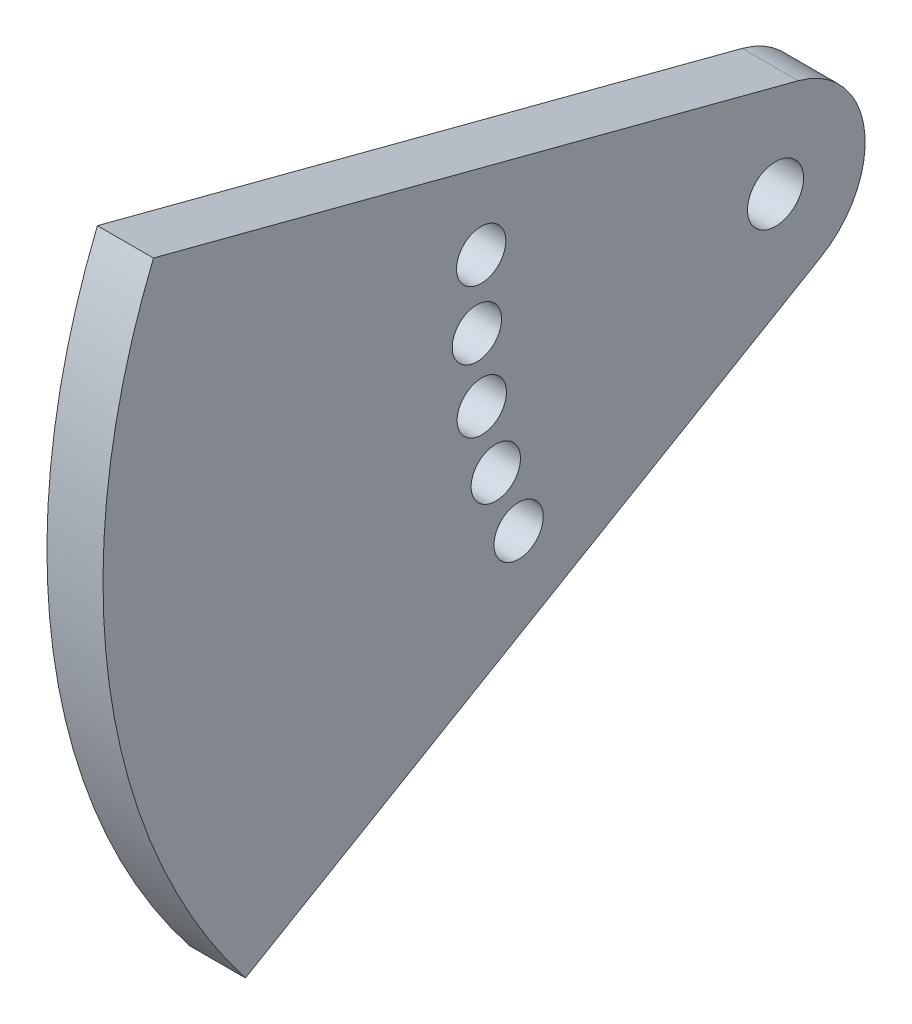
ISO-10303-21;
HEADER;
FILE_DESCRIPTION(('STEP AP214'),'2;1');
FILE_NAME('part.step','',(''),(''),'','','');
FILE_SCHEMA(('AUTOMOTIVE_DESIGN { 1 0 10303 214 1 1 1 1 }'));
ENDSEC;
DATA;
#1=APPLICATION_CONTEXT('core data for automotive mechanical design processes');
#2=APPLICATION_PROTOCOL_DEFINITION('international standard','automotive_design',2000,#1);
#3=PRODUCT_CONTEXT('',#1,'mechanical');
#4=PRODUCT('Part','Part','',(#3));
#5=PRODUCT_RELATED_PRODUCT_CATEGORY('part','',(#4));
#6=PRODUCT_DEFINITION_FORMATION('','',#4);
#7=PRODUCT_DEFINITION_CONTEXT('part definition',#1,'design');
#8=PRODUCT_DEFINITION('design','',#6,#7);
#9=PRODUCT_DEFINITION_SHAPE('','',#8);
#10=(LENGTH_UNIT() NAMED_UNIT(*) SI_UNIT(.MILLI.,.METRE.));
#11=(NAMED_UNIT(*) PLANE_ANGLE_UNIT() SI_UNIT($,.RADIAN.));
#12=(NAMED_UNIT(*) SI_UNIT($,.STERADIAN.) SOLID_ANGLE_UNIT());
#13=UNCERTAINTY_MEASURE_WITH_UNIT(LENGTH_MEASURE(1.E-05),#10,'distance_accuracy_value','');
#14=(GEOMETRIC_REPRESENTATION_CONTEXT(3) GLOBAL_UNCERTAINTY_ASSIGNED_CONTEXT((#13)) GLOBAL_UNIT_ASSIGNED_CONTEXT((#10,
#11,#12)) REPRESENTATION_CONTEXT('',''));
#15=CARTESIAN_POINT('',(0.,0.,0.));
#16=DIRECTION('',(0.,0.,1.));
#17=DIRECTION('',(1.,0.,0.));
#18=AXIS2_PLACEMENT_3D('',#15,#16,#17);
#19=CARTESIAN_POINT('',(6.35,0.,0.));
#20=DIRECTION('',(-1.,0.,0.));
#21=DIRECTION('',(0.,0.,1.));
#22=AXIS2_PLACEMENT_3D('',#19,#20,#21);
#23=CYLINDRICAL_SURFACE('',#22,10.16);
#24=CARTESIAN_POINT('',(0.,0.,0.));
#25=DIRECTION('',(1.,0.,0.));
#26=DIRECTION('',(0.,0.,-1.));
#27=AXIS2_PLACEMENT_3D('',#24,#25,#26);
#28=CIRCLE('',#27,10.16);
#29=CARTESIAN_POINT('',(0.,9.82856566886016,-2.57388750587578));
#30=VERTEX_POINT('',#29);
#31=CARTESIAN_POINT('',(0.,-8.7698587432044,-5.12983212437224));
#32=VERTEX_POINT('',#31);
#33=EDGE_CURVE('E117',#30,#32,#28,.F.);
#34=ORIENTED_EDGE('',*,*,#33,.F.);
#35=DIRECTION('',(-1.,0.,0.));
#36=VECTOR('',#35,1.);
#37=CARTESIAN_POINT('',(6.35,9.82856566886016,-2.57388750587578));
#38=LINE('',#37,#36);
#39=CARTESIAN_POINT('',(6.35,9.82856566886016,-2.57388750587578));
#40=VERTEX_POINT('',#39);
#41=EDGE_CURVE('E11',#40,#30,#38,.T.);
#42=ORIENTED_EDGE('',*,*,#41,.F.);
#43=CARTESIAN_POINT('',(6.35,0.,0.));
#44=DIRECTION('',(1.,0.,0.));
#45=DIRECTION('',(0.,0.,-1.));
#46=AXIS2_PLACEMENT_3D('',#43,#44,#45);
#47=CIRCLE('',#46,10.16);
#48=CARTESIAN_POINT('',(6.35,-8.7698587432044,-5.12983212437224));
#49=VERTEX_POINT('',#48);
#50=EDGE_CURVE('E84',#40,#49,#47,.F.);
#51=ORIENTED_EDGE('',*,*,#50,.T.);
#52=DIRECTION('',(-1.,0.,0.));
#53=VECTOR('',#52,1.);
#54=CARTESIAN_POINT('',(6.35,-8.7698587432044,-5.12983212437224));
#55=LINE('',#54,#53);
#56=EDGE_CURVE('E52',#49,#32,#55,.T.);
#57=ORIENTED_EDGE('',*,*,#56,.T.);
#58=EDGE_LOOP('',(#34,#42,#51,#57));
#59=FACE_BOUND('',#58,.T.);
#60=ADVANCED_FACE('F35',(#59),#23,.T.);
#61=CARTESIAN_POINT('',(6.35,9.82856566886016,-2.57388750587578));
#62=DIRECTION('',(0.,-0.967378510714583,0.253335384436593));
#63=DIRECTION('',(0.,-0.253335384436593,-0.967378510714583));
#64=AXIS2_PLACEMENT_3D('',#61,#62,#63);
#65=PLANE('',#64);
#66=DIRECTION('',(0.,0.253335384436593,0.967378510714583));
#67=VECTOR('',#66,1.);
#68=CARTESIAN_POINT('',(0.,9.82856566886016,-2.57388750587578));
#69=LINE('',#68,#67);
#70=CARTESIAN_POINT('',(0.,28.9603599739669,70.482178954529));
#71=VERTEX_POINT('',#70);
#72=EDGE_CURVE('E90',#30,#71,#69,.T.);
#73=ORIENTED_EDGE('',*,*,#72,.T.);
#74=DIRECTION('',(-1.,0.,0.));
#75=VECTOR('',#74,1.);
#76=CARTESIAN_POINT('',(6.35,28.9603599739669,70.482178954529));
#77=LINE('',#76,#75);
#78=CARTESIAN_POINT('',(6.35,28.9603599739669,70.482178954529));
#79=VERTEX_POINT('',#78);
#80=EDGE_CURVE('E44',#79,#71,#77,.T.);
#81=ORIENTED_EDGE('',*,*,#80,.F.);
#82=DIRECTION('',(0.,0.253335384436593,0.967378510714583));
#83=VECTOR('',#82,1.);
#84=CARTESIAN_POINT('',(6.35,9.82856566886016,-2.57388750587578));
#85=LINE('',#84,#83);
#86=EDGE_CURVE('E78',#40,#79,#85,.T.);
#87=ORIENTED_EDGE('',*,*,#86,.F.);
#88=ORIENTED_EDGE('',*,*,#41,.T.);
#89=EDGE_LOOP('',(#73,#81,#87,#88));
#90=FACE_BOUND('',#89,.T.);
#91=ADVANCED_FACE('F88',(#90),#65,.F.);
#92=CARTESIAN_POINT('',(6.35,0.,0.));
#93=DIRECTION('',(-1.,0.,0.));
#94=DIRECTION('',(0.,0.,1.));
#95=AXIS2_PLACEMENT_3D('',#92,#93,#94);
#96=CYLINDRICAL_SURFACE('',#95,76.2);
#97=CARTESIAN_POINT('',(0.,0.,0.));
#98=DIRECTION('',(1.,0.,0.));
#99=DIRECTION('',(0.,0.,-1.));
#100=AXIS2_PLACEMENT_3D('',#97,#98,#99);
#101=CIRCLE('',#100,76.2);
#102=CARTESIAN_POINT('',(0.,-46.9000772547647,60.0568293660022));
#103=VERTEX_POINT('',#102);
#104=EDGE_CURVE('E120',#103,#71,#101,.F.);
#105=ORIENTED_EDGE('',*,*,#104,.F.);
#106=DIRECTION('',(-1.,0.,0.));
#107=VECTOR('',#106,1.);
#108=CARTESIAN_POINT('',(6.35,-46.9000772547647,60.0568293660022));
#109=LINE('',#108,#107);
#110=CARTESIAN_POINT('',(6.35,-46.9000772547647,60.0568293660022));
#111=VERTEX_POINT('',#110);
#112=EDGE_CURVE('E65',#111,#103,#109,.T.);
#113=ORIENTED_EDGE('',*,*,#112,.F.);
#114=CARTESIAN_POINT('',(6.35,0.,0.));
#115=DIRECTION('',(1.,0.,0.));
#116=DIRECTION('',(0.,0.,-1.));
#117=AXIS2_PLACEMENT_3D('',#114,#115,#116);
#118=CIRCLE('',#117,76.2);
#119=EDGE_CURVE('E83',#111,#79,#118,.F.);
#120=ORIENTED_EDGE('',*,*,#119,.T.);
#121=ORIENTED_EDGE('',*,*,#80,.T.);
#122=EDGE_LOOP('',(#105,#113,#120,#121));
#123=FACE_BOUND('',#122,.T.);
#124=ADVANCED_FACE('F93',(#123),#96,.T.);
#125=CARTESIAN_POINT('',(6.35,10.6999868382995,33.3471670411148));
#126=DIRECTION('',(-1.,0.,0.));
#127=DIRECTION('',(0.,0.,1.));
#128=AXIS2_PLACEMENT_3D('',#125,#126,#127);
#129=CYLINDRICAL_SURFACE('',#128,2.794);
#130=CARTESIAN_POINT('',(6.35,10.6999868382995,33.3471670411148));
#131=DIRECTION('',(1.,0.,0.));
#132=DIRECTION('',(0.,0.,-1.));
#133=AXIS2_PLACEMENT_3D('',#130,#131,#132);
#134=CIRCLE('',#133,2.794);
#135=CARTESIAN_POINT('',(6.35,10.6999868382995,30.5531670411148));
#136=VERTEX_POINT('',#135);
#137=EDGE_CURVE('E145',#136,#136,#134,.T.);
#138=ORIENTED_EDGE('',*,*,#137,.T.);
#139=EDGE_LOOP('',(#138));
#140=FACE_BOUND('',#139,.T.);
#141=CARTESIAN_POINT('',(0.,10.6999868382995,33.3471670411148));
#142=DIRECTION('',(1.,0.,0.));
#143=DIRECTION('',(0.,0.,-1.));
#144=AXIS2_PLACEMENT_3D('',#141,#142,#143);
#145=CIRCLE('',#144,2.794);
#146=CARTESIAN_POINT('',(0.,10.6999868382995,30.5531670411148));
#147=VERTEX_POINT('',#146);
#148=EDGE_CURVE('E114',#147,#147,#145,.T.);
#149=ORIENTED_EDGE('',*,*,#148,.F.);
#150=EDGE_LOOP('',(#149));
#151=FACE_BOUND('',#150,.T.);
#152=ADVANCED_FACE('F167',(#140,#151),#129,.F.);
#153=CARTESIAN_POINT('',(6.35,3.25056568996349,33.8328164493452));
#154=DIRECTION('',(-1.,0.,0.));
#155=DIRECTION('',(0.,0.,1.));
#156=AXIS2_PLACEMENT_3D('',#153,#154,#155);
#157=CYLINDRICAL_SURFACE('',#156,2.79399999999999);
#158=CARTESIAN_POINT('',(6.35,3.25056568996349,33.8328164493452));
#159=DIRECTION('',(1.,0.,0.));
#160=DIRECTION('',(0.,0.,-1.));
#161=AXIS2_PLACEMENT_3D('',#158,#159,#160);
#162=CIRCLE('',#161,2.79399999999999);
#163=CARTESIAN_POINT('',(6.35,3.25056568996349,31.0388164493452));
#164=VERTEX_POINT('',#163);
#165=EDGE_CURVE('E142',#164,#164,#162,.T.);
#166=ORIENTED_EDGE('',*,*,#165,.T.);
#167=EDGE_LOOP('',(#166));
#168=FACE_BOUND('',#167,.T.);
#169=CARTESIAN_POINT('',(0.,3.25056568996349,33.8328164493452));
#170=DIRECTION('',(1.,0.,0.));
#171=DIRECTION('',(0.,0.,-1.));
#172=AXIS2_PLACEMENT_3D('',#169,#170,#171);
#173=CIRCLE('',#172,2.79399999999999);
#174=CARTESIAN_POINT('',(0.,3.25056568996349,31.0388164493452));
#175=VERTEX_POINT('',#174);
#176=EDGE_CURVE('E111',#175,#175,#173,.T.);
#177=ORIENTED_EDGE('',*,*,#176,.F.);
#178=EDGE_LOOP('',(#177));
#179=FACE_BOUND('',#178,.T.);
#180=ADVANCED_FACE('F170',(#168,#179),#157,.F.);
#181=CARTESIAN_POINT('',(6.35,-4.19394753796468,33.2769805093475));
#182=DIRECTION('',(-1.,0.,0.));
#183=DIRECTION('',(0.,0.,1.));
#184=AXIS2_PLACEMENT_3D('',#181,#182,#183);
#185=CYLINDRICAL_SURFACE('',#184,2.794);
#186=CARTESIAN_POINT('',(6.35,-4.19394753796468,33.2769805093475));
#187=DIRECTION('',(1.,0.,0.));
#188=DIRECTION('',(0.,0.,-1.));
#189=AXIS2_PLACEMENT_3D('',#186,#187,#188);
#190=CIRCLE('',#189,2.794);
#191=CARTESIAN_POINT('',(6.35,-4.19394753796468,30.4829805093475));
#192=VERTEX_POINT('',#191);
#193=EDGE_CURVE('E139',#192,#192,#190,.T.);
#194=ORIENTED_EDGE('',*,*,#193,.T.);
#195=EDGE_LOOP('',(#194));
#196=FACE_BOUND('',#195,.T.);
#197=CARTESIAN_POINT('',(0.,-4.19394753796468,33.2769805093475));
#198=DIRECTION('',(1.,0.,0.));
#199=DIRECTION('',(0.,0.,-1.));
#200=AXIS2_PLACEMENT_3D('',#197,#198,#199);
#201=CIRCLE('',#200,2.794);
#202=CARTESIAN_POINT('',(0.,-4.19394753796468,30.4829805093475));
#203=VERTEX_POINT('',#202);
#204=EDGE_CURVE('E108',#203,#203,#201,.T.);
#205=ORIENTED_EDGE('',*,*,#204,.F.);
#206=EDGE_LOOP('',(#205));
#207=FACE_BOUND('',#206,.T.);
#208=ADVANCED_FACE('F174',(#196,#207),#185,.F.);
#209=CARTESIAN_POINT('',(6.35,-11.4886538635116,31.6904779354398));
#210=DIRECTION('',(-1.,0.,0.));
#211=DIRECTION('',(0.,0.,1.));
#212=AXIS2_PLACEMENT_3D('',#209,#210,#211);
#213=CYLINDRICAL_SURFACE('',#212,2.794);
#214=CARTESIAN_POINT('',(6.35,-11.4886538635116,31.6904779354398));
#215=DIRECTION('',(1.,0.,0.));
#216=DIRECTION('',(0.,0.,-1.));
#217=AXIS2_PLACEMENT_3D('',#214,#215,#216);
#218=CIRCLE('',#217,2.794);
#219=CARTESIAN_POINT('',(6.35,-11.4886538635116,28.8964779354398));
#220=VERTEX_POINT('',#219);
#221=EDGE_CURVE('E134',#220,#220,#218,.T.);
#222=ORIENTED_EDGE('',*,*,#221,.T.);
#223=EDGE_LOOP('',(#222));
#224=FACE_BOUND('',#223,.T.);
#225=CARTESIAN_POINT('',(0.,-11.4886538635116,31.6904779354398));
#226=DIRECTION('',(1.,0.,0.));
#227=DIRECTION('',(0.,0.,-1.));
#228=AXIS2_PLACEMENT_3D('',#225,#226,#227);
#229=CIRCLE('',#228,2.794);
#230=CARTESIAN_POINT('',(0.,-11.4886538635116,28.8964779354398));
#231=VERTEX_POINT('',#230);
#232=EDGE_CURVE('E105',#231,#231,#229,.T.);
#233=ORIENTED_EDGE('',*,*,#232,.F.);
#234=EDGE_LOOP('',(#233));
#235=FACE_BOUND('',#234,.T.);
#236=ADVANCED_FACE('F178',(#224,#235),#213,.F.);
#237=CARTESIAN_POINT('',(6.35,-18.4915701256561,29.1041881956034));
#238=DIRECTION('',(-1.,0.,0.));
#239=DIRECTION('',(0.,0.,1.));
#240=AXIS2_PLACEMENT_3D('',#237,#238,#239);
#241=CYLINDRICAL_SURFACE('',#240,2.79400000000008);
#242=CARTESIAN_POINT('',(6.35,-18.4915701256561,29.1041881956034));
#243=DIRECTION('',(1.,0.,0.));
#244=DIRECTION('',(0.,0.,-1.));
#245=AXIS2_PLACEMENT_3D('',#242,#243,#244);
#246=CIRCLE('',#245,2.79400000000008);
#247=CARTESIAN_POINT('',(6.35,-18.4915701256561,26.3101881956033));
#248=VERTEX_POINT('',#247);
#249=EDGE_CURVE('E129',#248,#248,#246,.T.);
#250=ORIENTED_EDGE('',*,*,#249,.T.);
#251=EDGE_LOOP('',(#250));
#252=FACE_BOUND('',#251,.T.);
#253=CARTESIAN_POINT('',(0.,-18.4915701256561,29.1041881956034));
#254=DIRECTION('',(1.,0.,0.));
#255=DIRECTION('',(0.,0.,-1.));
#256=AXIS2_PLACEMENT_3D('',#253,#254,#255);
#257=CIRCLE('',#256,2.79400000000008);
#258=CARTESIAN_POINT('',(0.,-18.4915701256561,26.3101881956033));
#259=VERTEX_POINT('',#258);
#260=EDGE_CURVE('E102',#259,#259,#257,.T.);
#261=ORIENTED_EDGE('',*,*,#260,.F.);
#262=EDGE_LOOP('',(#261));
#263=FACE_BOUND('',#262,.T.);
#264=ADVANCED_FACE('F157',(#252,#263),#241,.F.);
#265=CARTESIAN_POINT('',(6.35,0.,0.));
#266=DIRECTION('',(-1.,0.,0.));
#267=DIRECTION('',(0.,0.,1.));
#268=AXIS2_PLACEMENT_3D('',#265,#266,#267);
#269=CYLINDRICAL_SURFACE('',#268,3.175);
#270=CARTESIAN_POINT('',(6.35,0.,0.));
#271=DIRECTION('',(1.,0.,0.));
#272=DIRECTION('',(0.,0.,-1.));
#273=AXIS2_PLACEMENT_3D('',#270,#271,#272);
#274=CIRCLE('',#273,3.175);
#275=CARTESIAN_POINT('',(6.35,0.,-3.175));
#276=VERTEX_POINT('',#275);
#277=EDGE_CURVE('E125',#276,#276,#274,.T.);
#278=ORIENTED_EDGE('',*,*,#277,.T.);
#279=EDGE_LOOP('',(#278));
#280=FACE_BOUND('',#279,.T.);
#281=CARTESIAN_POINT('',(0.,0.,0.));
#282=DIRECTION('',(1.,0.,0.));
#283=DIRECTION('',(0.,0.,-1.));
#284=AXIS2_PLACEMENT_3D('',#281,#282,#283);
#285=CIRCLE('',#284,3.175);
#286=CARTESIAN_POINT('',(0.,0.,-3.175));
#287=VERTEX_POINT('',#286);
#288=EDGE_CURVE('E99',#287,#287,#285,.T.);
#289=ORIENTED_EDGE('',*,*,#288,.F.);
#290=EDGE_LOOP('',(#289));
#291=FACE_BOUND('',#290,.T.);
#292=ADVANCED_FACE('F37',(#280,#291),#269,.F.);
#293=CARTESIAN_POINT('',(6.35,-8.7698587432044,-5.12983212437224));
#294=DIRECTION('',(0.,-0.863175073150039,-0.50490473665081));
#295=DIRECTION('',(0.,0.50490473665081,-0.863175073150039));
#296=AXIS2_PLACEMENT_3D('',#293,#294,#295);
#297=PLANE('',#296);
#298=DIRECTION('',(0.,-0.50490473665081,0.863175073150039));
#299=VECTOR('',#298,1.);
#300=CARTESIAN_POINT('',(0.,-8.7698587432044,-5.12983212437224));
#301=LINE('',#300,#299);
#302=EDGE_CURVE('E122',#32,#103,#301,.T.);
#303=ORIENTED_EDGE('',*,*,#302,.F.);
#304=ORIENTED_EDGE('',*,*,#56,.F.);
#305=DIRECTION('',(0.,-0.50490473665081,0.863175073150039));
#306=VECTOR('',#305,1.);
#307=CARTESIAN_POINT('',(6.35,-8.7698587432044,-5.12983212437224));
#308=LINE('',#307,#306);
#309=EDGE_CURVE('E94',#49,#111,#308,.T.);
#310=ORIENTED_EDGE('',*,*,#309,.T.);
#311=ORIENTED_EDGE('',*,*,#112,.T.);
#312=EDGE_LOOP('',(#303,#304,#310,#311));
#313=FACE_BOUND('',#312,.T.);
#314=ADVANCED_FACE('F147',(#313),#297,.T.);
#315=CARTESIAN_POINT('',(6.35,0.,0.));
#316=DIRECTION('',(1.,0.,0.));
#317=DIRECTION('',(0.,0.,-1.));
#318=AXIS2_PLACEMENT_3D('',#315,#316,#317);
#319=PLANE('',#318);
#320=ORIENTED_EDGE('',*,*,#277,.F.);
#321=EDGE_LOOP('',(#320));
#322=FACE_BOUND('',#321,.T.);
#323=ORIENTED_EDGE('',*,*,#249,.F.);
#324=EDGE_LOOP('',(#323));
#325=FACE_BOUND('',#324,.T.);
#326=ORIENTED_EDGE('',*,*,#221,.F.);
#327=EDGE_LOOP('',(#326));
#328=FACE_BOUND('',#327,.T.);
#329=ORIENTED_EDGE('',*,*,#193,.F.);
#330=EDGE_LOOP('',(#329));
#331=FACE_BOUND('',#330,.T.);
#332=ORIENTED_EDGE('',*,*,#165,.F.);
#333=EDGE_LOOP('',(#332));
#334=FACE_BOUND('',#333,.T.);
#335=ORIENTED_EDGE('',*,*,#137,.F.);
#336=EDGE_LOOP('',(#335));
#337=FACE_BOUND('',#336,.T.);
#338=ORIENTED_EDGE('',*,*,#50,.F.);
#339=ORIENTED_EDGE('',*,*,#86,.T.);
#340=ORIENTED_EDGE('',*,*,#119,.F.);
#341=ORIENTED_EDGE('',*,*,#309,.F.);
#342=EDGE_LOOP('',(#338,#339,#340,#341));
#343=FACE_BOUND('',#342,.T.);
#344=ADVANCED_FACE('F80',(#322,#325,#328,#331,#334,#337,#343),#319,.T.);
#345=CARTESIAN_POINT('',(0.,0.,0.));
#346=DIRECTION('',(1.,0.,0.));
#347=DIRECTION('',(0.,0.,-1.));
#348=AXIS2_PLACEMENT_3D('',#345,#346,#347);
#349=PLANE('',#348);
#350=ORIENTED_EDGE('',*,*,#288,.T.);
#351=EDGE_LOOP('',(#350));
#352=FACE_BOUND('',#351,.T.);
#353=ORIENTED_EDGE('',*,*,#260,.T.);
#354=EDGE_LOOP('',(#353));
#355=FACE_BOUND('',#354,.T.);
#356=ORIENTED_EDGE('',*,*,#232,.T.);
#357=EDGE_LOOP('',(#356));
#358=FACE_BOUND('',#357,.T.);
#359=ORIENTED_EDGE('',*,*,#204,.T.);
#360=EDGE_LOOP('',(#359));
#361=FACE_BOUND('',#360,.T.);
#362=ORIENTED_EDGE('',*,*,#176,.T.);
#363=EDGE_LOOP('',(#362));
#364=FACE_BOUND('',#363,.T.);
#365=ORIENTED_EDGE('',*,*,#148,.T.);
#366=EDGE_LOOP('',(#365));
#367=FACE_BOUND('',#366,.T.);
#368=ORIENTED_EDGE('',*,*,#33,.T.);
#369=ORIENTED_EDGE('',*,*,#302,.T.);
#370=ORIENTED_EDGE('',*,*,#104,.T.);
#371=ORIENTED_EDGE('',*,*,#72,.F.);
#372=EDGE_LOOP('',(#368,#369,#370,#371));
#373=FACE_BOUND('',#372,.T.);
#374=ADVANCED_FACE('F154',(#352,#355,#358,#361,#364,#367,#373),#349,.F.);
#375=CLOSED_SHELL('',(#60,#91,#124,#152,#180,#208,#236,#264,#292,#314,#344,#374));
#376=MANIFOLD_SOLID_BREP('B2',#375);
#377=ADVANCED_BREP_SHAPE_REPRESENTATION('',(#18,#376),#14);
#378=SHAPE_DEFINITION_REPRESENTATION(#9,#377);
ENDSEC;
END-ISO-10303-21;
